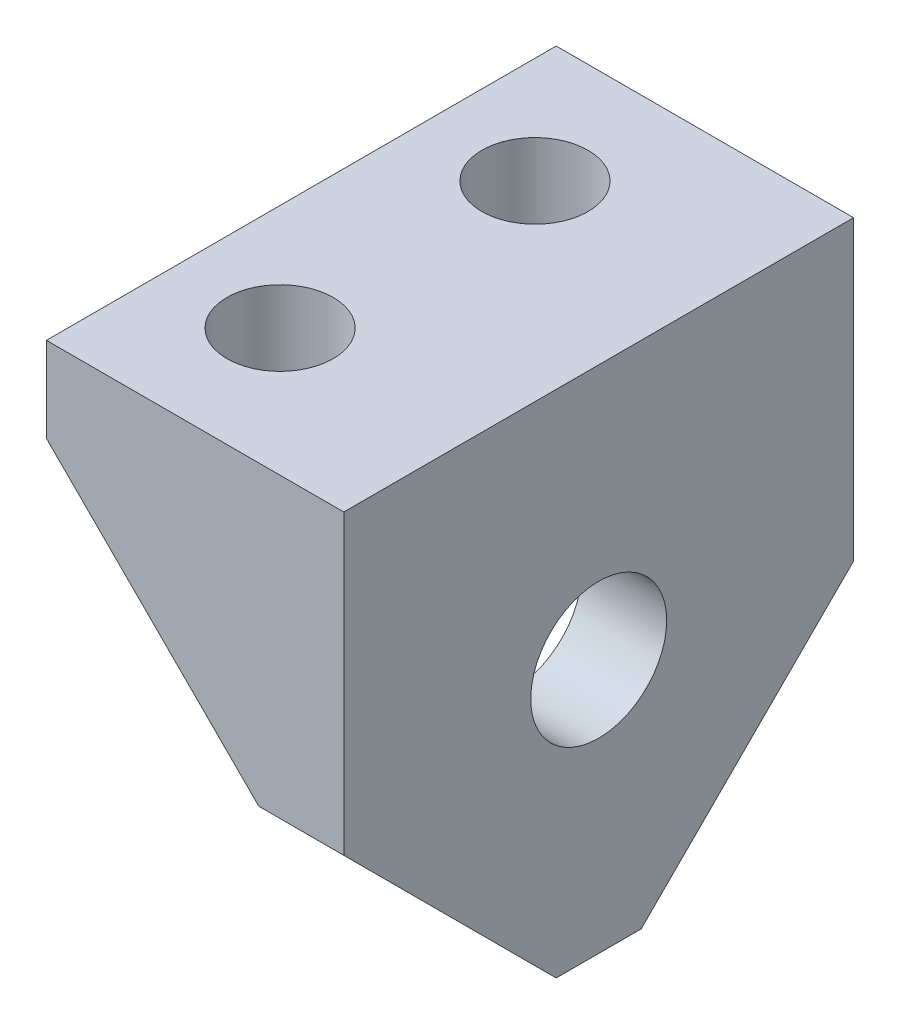
ISO-10303-21;
HEADER;
FILE_DESCRIPTION(('STEP AP214'),'2;1');
FILE_NAME('part.step','',(''),(''),'','','');
FILE_SCHEMA(('AUTOMOTIVE_DESIGN { 1 0 10303 214 1 1 1 1 }'));
ENDSEC;
DATA;
#1=APPLICATION_CONTEXT('core data for automotive mechanical design processes');
#2=APPLICATION_PROTOCOL_DEFINITION('international standard','automotive_design',2000,#1);
#3=PRODUCT_CONTEXT('',#1,'mechanical');
#4=PRODUCT('Part','Part','',(#3));
#5=PRODUCT_RELATED_PRODUCT_CATEGORY('part','',(#4));
#6=PRODUCT_DEFINITION_FORMATION('','',#4);
#7=PRODUCT_DEFINITION_CONTEXT('part definition',#1,'design');
#8=PRODUCT_DEFINITION('design','',#6,#7);
#9=PRODUCT_DEFINITION_SHAPE('','',#8);
#10=(LENGTH_UNIT() NAMED_UNIT(*) SI_UNIT(.MILLI.,.METRE.));
#11=(NAMED_UNIT(*) PLANE_ANGLE_UNIT() SI_UNIT($,.RADIAN.));
#12=(NAMED_UNIT(*) SI_UNIT($,.STERADIAN.) SOLID_ANGLE_UNIT());
#13=UNCERTAINTY_MEASURE_WITH_UNIT(LENGTH_MEASURE(1.E-05),#10,'distance_accuracy_value','');
#14=(GEOMETRIC_REPRESENTATION_CONTEXT(3) GLOBAL_UNCERTAINTY_ASSIGNED_CONTEXT((#13)) GLOBAL_UNIT_ASSIGNED_CONTEXT((#10,
#11,#12)) REPRESENTATION_CONTEXT('',''));
#15=CARTESIAN_POINT('',(0.,0.,0.));
#16=DIRECTION('',(0.,0.,1.));
#17=DIRECTION('',(1.,0.,0.));
#18=AXIS2_PLACEMENT_3D('',#15,#16,#17);
#19=CARTESIAN_POINT('',(0.,0.,0.));
#20=DIRECTION('',(1.,0.,0.));
#21=DIRECTION('',(0.,0.,-1.));
#22=AXIS2_PLACEMENT_3D('',#19,#20,#21);
#23=PLANE('',#22);
#24=CARTESIAN_POINT('',(0.,-1.51177041663371,0.));
#25=DIRECTION('',(1.,0.,0.));
#26=DIRECTION('',(0.,0.,-1.));
#27=AXIS2_PLACEMENT_3D('',#24,#25,#26);
#28=CIRCLE('',#27,1.6);
#29=CARTESIAN_POINT('',(0.,-1.51177041663371,-1.6));
#30=VERTEX_POINT('',#29);
#31=EDGE_CURVE('E195',#30,#30,#28,.T.);
#32=ORIENTED_EDGE('',*,*,#31,.T.);
#33=EDGE_LOOP('',(#32));
#34=FACE_BOUND('',#33,.T.);
#35=DIRECTION('',(0.,0.,-1.));
#36=VECTOR('',#35,1.);
#37=CARTESIAN_POINT('',(0.,-2.5,-4.5));
#38=LINE('',#37,#36);
#39=CARTESIAN_POINT('',(0.,-2.5,-4.5));
#40=VERTEX_POINT('',#39);
#41=CARTESIAN_POINT('',(0.,-2.5,-6.));
#42=VERTEX_POINT('',#41);
#43=EDGE_CURVE('E120',#40,#42,#38,.T.);
#44=ORIENTED_EDGE('',*,*,#43,.T.);
#45=DIRECTION('',(0.,-0.707106781186548,0.707106781186548));
#46=VECTOR('',#45,1.);
#47=CARTESIAN_POINT('',(0.,-4.25,-4.25));
#48=LINE('',#47,#46);
#49=CARTESIAN_POINT('',(0.,-7.5,-1.));
#50=VERTEX_POINT('',#49);
#51=EDGE_CURVE('E139',#42,#50,#48,.T.);
#52=ORIENTED_EDGE('',*,*,#51,.T.);
#53=DIRECTION('',(0.,0.,-1.));
#54=VECTOR('',#53,1.);
#55=CARTESIAN_POINT('',(0.,-7.5,6.));
#56=LINE('',#55,#54);
#57=CARTESIAN_POINT('',(0.,-7.5,0.999999999999998));
#58=VERTEX_POINT('',#57);
#59=EDGE_CURVE('E149',#58,#50,#56,.T.);
#60=ORIENTED_EDGE('',*,*,#59,.F.);
#61=DIRECTION('',(0.,0.707106781186547,0.707106781186548));
#62=VECTOR('',#61,1.);
#63=CARTESIAN_POINT('',(0.,-4.25,4.25));
#64=LINE('',#63,#62);
#65=CARTESIAN_POINT('',(0.,-2.5,6.));
#66=VERTEX_POINT('',#65);
#67=EDGE_CURVE('E134',#58,#66,#64,.T.);
#68=ORIENTED_EDGE('',*,*,#67,.T.);
#69=DIRECTION('',(0.,0.,1.));
#70=VECTOR('',#69,1.);
#71=CARTESIAN_POINT('',(0.,-2.5,4.5));
#72=LINE('',#71,#70);
#73=CARTESIAN_POINT('',(0.,-2.5,4.5));
#74=VERTEX_POINT('',#73);
#75=EDGE_CURVE('E217',#74,#66,#72,.T.);
#76=ORIENTED_EDGE('',*,*,#75,.F.);
#77=DIRECTION('',(0.,1.,0.));
#78=VECTOR('',#77,1.);
#79=CARTESIAN_POINT('',(0.,2.5,4.5));
#80=LINE('',#79,#78);
#81=CARTESIAN_POINT('',(0.,2.5,4.5));
#82=VERTEX_POINT('',#81);
#83=EDGE_CURVE('E132',#74,#82,#80,.T.);
#84=ORIENTED_EDGE('',*,*,#83,.T.);
#85=DIRECTION('',(0.,0.,1.));
#86=VECTOR('',#85,1.);
#87=CARTESIAN_POINT('',(0.,2.5,-6.));
#88=LINE('',#87,#86);
#89=CARTESIAN_POINT('',(0.,2.5,-4.5));
#90=VERTEX_POINT('',#89);
#91=EDGE_CURVE('E125',#90,#82,#88,.T.);
#92=ORIENTED_EDGE('',*,*,#91,.F.);
#93=DIRECTION('',(0.,1.,0.));
#94=VECTOR('',#93,1.);
#95=CARTESIAN_POINT('',(0.,2.5,-4.5));
#96=LINE('',#95,#94);
#97=EDGE_CURVE('E112',#40,#90,#96,.T.);
#98=ORIENTED_EDGE('',*,*,#97,.F.);
#99=EDGE_LOOP('',(#44,#52,#60,#68,#76,#84,#92,#98));
#100=FACE_BOUND('',#99,.T.);
#101=ADVANCED_FACE('F36',(#34,#100),#23,.F.);
#102=CARTESIAN_POINT('',(2.,4.5,6.));
#103=DIRECTION('',(0.,0.,-1.));
#104=DIRECTION('',(0.,1.,0.));
#105=AXIS2_PLACEMENT_3D('',#102,#103,#104);
#106=PLANE('',#105);
#107=DIRECTION('',(0.707106781186548,-0.707106781186548,0.));
#108=VECTOR('',#107,1.);
#109=CARTESIAN_POINT('',(-5.,2.5,6.));
#110=LINE('',#109,#108);
#111=CARTESIAN_POINT('',(-5.,2.5,6.));
#112=VERTEX_POINT('',#111);
#113=EDGE_CURVE('E221',#112,#66,#110,.T.);
#114=ORIENTED_EDGE('',*,*,#113,.T.);
#115=DIRECTION('',(1.,0.,0.));
#116=VECTOR('',#115,1.);
#117=CARTESIAN_POINT('',(-3.,-2.5,6.));
#118=LINE('',#117,#116);
#119=CARTESIAN_POINT('',(2.,-2.5,6.));
#120=VERTEX_POINT('',#119);
#121=EDGE_CURVE('E187',#66,#120,#118,.T.);
#122=ORIENTED_EDGE('',*,*,#121,.T.);
#123=DIRECTION('',(0.,-1.,0.));
#124=VECTOR('',#123,1.);
#125=CARTESIAN_POINT('',(2.,4.5,6.));
#126=LINE('',#125,#124);
#127=CARTESIAN_POINT('',(2.,4.5,6.));
#128=VERTEX_POINT('',#127);
#129=EDGE_CURVE('E145',#128,#120,#126,.T.);
#130=ORIENTED_EDGE('',*,*,#129,.F.);
#131=DIRECTION('',(-1.,0.,0.));
#132=VECTOR('',#131,1.);
#133=CARTESIAN_POINT('',(2.,4.5,6.));
#134=LINE('',#133,#132);
#135=CARTESIAN_POINT('',(-5.,4.5,6.));
#136=VERTEX_POINT('',#135);
#137=EDGE_CURVE('E44',#128,#136,#134,.T.);
#138=ORIENTED_EDGE('',*,*,#137,.T.);
#139=DIRECTION('',(0.,1.,0.));
#140=VECTOR('',#139,1.);
#141=CARTESIAN_POINT('',(-5.,4.5,6.));
#142=LINE('',#141,#140);
#143=EDGE_CURVE('E163',#112,#136,#142,.T.);
#144=ORIENTED_EDGE('',*,*,#143,.F.);
#145=EDGE_LOOP('',(#114,#122,#130,#138,#144));
#146=FACE_BOUND('',#145,.T.);
#147=ADVANCED_FACE('F38',(#146),#106,.F.);
#148=CARTESIAN_POINT('',(2.,-7.5,6.));
#149=DIRECTION('',(0.,1.,0.));
#150=DIRECTION('',(0.,0.,1.));
#151=AXIS2_PLACEMENT_3D('',#148,#149,#150);
#152=PLANE('',#151);
#153=DIRECTION('',(0.,0.,-1.));
#154=VECTOR('',#153,1.);
#155=CARTESIAN_POINT('',(2.,-7.5,6.));
#156=LINE('',#155,#154);
#157=CARTESIAN_POINT('',(2.,-7.5,0.999999999999998));
#158=VERTEX_POINT('',#157);
#159=CARTESIAN_POINT('',(2.,-7.5,-1.));
#160=VERTEX_POINT('',#159);
#161=EDGE_CURVE('E148',#158,#160,#156,.T.);
#162=ORIENTED_EDGE('',*,*,#161,.F.);
#163=DIRECTION('',(1.,0.,0.));
#164=VECTOR('',#163,1.);
#165=CARTESIAN_POINT('',(-3.,-7.5,0.999999999999998));
#166=LINE('',#165,#164);
#167=EDGE_CURVE('E196',#58,#158,#166,.T.);
#168=ORIENTED_EDGE('',*,*,#167,.F.);
#169=ORIENTED_EDGE('',*,*,#59,.T.);
#170=DIRECTION('',(1.,0.,0.));
#171=VECTOR('',#170,1.);
#172=CARTESIAN_POINT('',(-3.,-7.5,-1.));
#173=LINE('',#172,#171);
#174=EDGE_CURVE('E189',#50,#160,#173,.T.);
#175=ORIENTED_EDGE('',*,*,#174,.T.);
#176=EDGE_LOOP('',(#162,#168,#169,#175));
#177=FACE_BOUND('',#176,.T.);
#178=ADVANCED_FACE('F235',(#177),#152,.F.);
#179=CARTESIAN_POINT('',(2.,4.5,-6.));
#180=DIRECTION('',(0.,0.,1.));
#181=DIRECTION('',(0.,-1.,0.));
#182=AXIS2_PLACEMENT_3D('',#179,#180,#181);
#183=PLANE('',#182);
#184=DIRECTION('',(0.,1.,0.));
#185=VECTOR('',#184,1.);
#186=CARTESIAN_POINT('',(2.,4.5,-6.));
#187=LINE('',#186,#185);
#188=CARTESIAN_POINT('',(2.,-2.5,-6.));
#189=VERTEX_POINT('',#188);
#190=CARTESIAN_POINT('',(2.,4.5,-6.));
#191=VERTEX_POINT('',#190);
#192=EDGE_CURVE('E152',#189,#191,#187,.T.);
#193=ORIENTED_EDGE('',*,*,#192,.F.);
#194=DIRECTION('',(1.,0.,0.));
#195=VECTOR('',#194,1.);
#196=CARTESIAN_POINT('',(-3.,-2.5,-6.));
#197=LINE('',#196,#195);
#198=EDGE_CURVE('E59',#42,#189,#197,.T.);
#199=ORIENTED_EDGE('',*,*,#198,.F.);
#200=DIRECTION('',(0.707106781186548,-0.707106781186548,0.));
#201=VECTOR('',#200,1.);
#202=CARTESIAN_POINT('',(-5.,2.5,-6.));
#203=LINE('',#202,#201);
#204=CARTESIAN_POINT('',(-5.,2.5,-6.));
#205=VERTEX_POINT('',#204);
#206=EDGE_CURVE('E182',#205,#42,#203,.T.);
#207=ORIENTED_EDGE('',*,*,#206,.F.);
#208=DIRECTION('',(0.,-1.,0.));
#209=VECTOR('',#208,1.);
#210=CARTESIAN_POINT('',(-5.,4.5,-6.));
#211=LINE('',#210,#209);
#212=CARTESIAN_POINT('',(-5.,4.5,-6.));
#213=VERTEX_POINT('',#212);
#214=EDGE_CURVE('E133',#213,#205,#211,.T.);
#215=ORIENTED_EDGE('',*,*,#214,.F.);
#216=DIRECTION('',(-1.,0.,0.));
#217=VECTOR('',#216,1.);
#218=CARTESIAN_POINT('',(2.,4.5,-6.));
#219=LINE('',#218,#217);
#220=EDGE_CURVE('E11',#191,#213,#219,.T.);
#221=ORIENTED_EDGE('',*,*,#220,.F.);
#222=EDGE_LOOP('',(#193,#199,#207,#215,#221));
#223=FACE_BOUND('',#222,.T.);
#224=ADVANCED_FACE('F180',(#223),#183,.F.);
#225=CARTESIAN_POINT('',(2.,4.5,6.));
#226=DIRECTION('',(0.,-1.,0.));
#227=DIRECTION('',(0.,0.,-1.));
#228=AXIS2_PLACEMENT_3D('',#225,#226,#227);
#229=PLANE('',#228);
#230=CARTESIAN_POINT('',(-2.5,4.5,3.));
#231=DIRECTION('',(0.,-1.,0.));
#232=DIRECTION('',(0.,0.,-1.));
#233=AXIS2_PLACEMENT_3D('',#230,#231,#232);
#234=CIRCLE('',#233,1.25);
#235=CARTESIAN_POINT('',(-2.5,4.5,1.75));
#236=VERTEX_POINT('',#235);
#237=EDGE_CURVE('E205',#236,#236,#234,.T.);
#238=ORIENTED_EDGE('',*,*,#237,.T.);
#239=EDGE_LOOP('',(#238));
#240=FACE_BOUND('',#239,.T.);
#241=CARTESIAN_POINT('',(-2.5,4.5,-3.));
#242=DIRECTION('',(0.,-1.,0.));
#243=DIRECTION('',(0.,0.,-1.));
#244=AXIS2_PLACEMENT_3D('',#241,#242,#243);
#245=CIRCLE('',#244,1.25);
#246=CARTESIAN_POINT('',(-2.5,4.5,-4.25));
#247=VERTEX_POINT('',#246);
#248=EDGE_CURVE('E208',#247,#247,#245,.T.);
#249=ORIENTED_EDGE('',*,*,#248,.T.);
#250=EDGE_LOOP('',(#249));
#251=FACE_BOUND('',#250,.T.);
#252=ORIENTED_EDGE('',*,*,#220,.T.);
#253=DIRECTION('',(0.,0.,-1.));
#254=VECTOR('',#253,1.);
#255=CARTESIAN_POINT('',(-5.,4.5,-6.));
#256=LINE('',#255,#254);
#257=EDGE_CURVE('E143',#136,#213,#256,.T.);
#258=ORIENTED_EDGE('',*,*,#257,.F.);
#259=ORIENTED_EDGE('',*,*,#137,.F.);
#260=DIRECTION('',(0.,0.,1.));
#261=VECTOR('',#260,1.);
#262=CARTESIAN_POINT('',(2.,4.5,6.));
#263=LINE('',#262,#261);
#264=EDGE_CURVE('E154',#191,#128,#263,.T.);
#265=ORIENTED_EDGE('',*,*,#264,.F.);
#266=EDGE_LOOP('',(#252,#258,#259,#265));
#267=FACE_BOUND('',#266,.T.);
#268=ADVANCED_FACE('F176',(#240,#251,#267),#229,.F.);
#269=CARTESIAN_POINT('',(2.,0.,0.));
#270=DIRECTION('',(1.,0.,0.));
#271=DIRECTION('',(0.,0.,-1.));
#272=AXIS2_PLACEMENT_3D('',#269,#270,#271);
#273=PLANE('',#272);
#274=CARTESIAN_POINT('',(2.,-1.51177041663371,0.));
#275=DIRECTION('',(1.,0.,0.));
#276=DIRECTION('',(0.,0.,-1.));
#277=AXIS2_PLACEMENT_3D('',#274,#275,#276);
#278=CIRCLE('',#277,1.6);
#279=CARTESIAN_POINT('',(2.,-1.51177041663371,-1.6));
#280=VERTEX_POINT('',#279);
#281=EDGE_CURVE('E202',#280,#280,#278,.T.);
#282=ORIENTED_EDGE('',*,*,#281,.F.);
#283=EDGE_LOOP('',(#282));
#284=FACE_BOUND('',#283,.T.);
#285=DIRECTION('',(0.,0.707106781186547,0.707106781186548));
#286=VECTOR('',#285,1.);
#287=CARTESIAN_POINT('',(2.,-2.5,6.));
#288=LINE('',#287,#286);
#289=EDGE_CURVE('E193',#158,#120,#288,.T.);
#290=ORIENTED_EDGE('',*,*,#289,.F.);
#291=ORIENTED_EDGE('',*,*,#161,.T.);
#292=DIRECTION('',(0.,-0.707106781186548,0.707106781186548));
#293=VECTOR('',#292,1.);
#294=CARTESIAN_POINT('',(2.,-2.5,-6.));
#295=LINE('',#294,#293);
#296=EDGE_CURVE('E190',#189,#160,#295,.T.);
#297=ORIENTED_EDGE('',*,*,#296,.F.);
#298=ORIENTED_EDGE('',*,*,#192,.T.);
#299=ORIENTED_EDGE('',*,*,#264,.T.);
#300=ORIENTED_EDGE('',*,*,#129,.T.);
#301=EDGE_LOOP('',(#290,#291,#297,#298,#299,#300));
#302=FACE_BOUND('',#301,.T.);
#303=ADVANCED_FACE('F239',(#284,#302),#273,.T.);
#304=CARTESIAN_POINT('',(-5.,2.5,-6.));
#305=DIRECTION('',(0.,1.,0.));
#306=DIRECTION('',(0.,0.,1.));
#307=AXIS2_PLACEMENT_3D('',#304,#305,#306);
#308=PLANE('',#307);
#309=CARTESIAN_POINT('',(-2.5,2.5,3.));
#310=DIRECTION('',(0.,-1.,0.));
#311=DIRECTION('',(0.,0.,-1.));
#312=AXIS2_PLACEMENT_3D('',#309,#310,#311);
#313=CIRCLE('',#312,1.25);
#314=CARTESIAN_POINT('',(-2.5,2.5,1.75));
#315=VERTEX_POINT('',#314);
#316=EDGE_CURVE('E211',#315,#315,#313,.T.);
#317=ORIENTED_EDGE('',*,*,#316,.F.);
#318=EDGE_LOOP('',(#317));
#319=FACE_BOUND('',#318,.T.);
#320=CARTESIAN_POINT('',(-2.5,2.5,-3.));
#321=DIRECTION('',(0.,-1.,0.));
#322=DIRECTION('',(0.,0.,-1.));
#323=AXIS2_PLACEMENT_3D('',#320,#321,#322);
#324=CIRCLE('',#323,1.25);
#325=CARTESIAN_POINT('',(-2.5,2.5,-4.25));
#326=VERTEX_POINT('',#325);
#327=EDGE_CURVE('E212',#326,#326,#324,.T.);
#328=ORIENTED_EDGE('',*,*,#327,.F.);
#329=EDGE_LOOP('',(#328));
#330=FACE_BOUND('',#329,.T.);
#331=DIRECTION('',(0.,0.,1.));
#332=VECTOR('',#331,1.);
#333=CARTESIAN_POINT('',(-5.,2.5,-6.));
#334=LINE('',#333,#332);
#335=CARTESIAN_POINT('',(-5.,2.5,-4.5));
#336=VERTEX_POINT('',#335);
#337=CARTESIAN_POINT('',(-5.,2.5,4.5));
#338=VERTEX_POINT('',#337);
#339=EDGE_CURVE('E127',#336,#338,#334,.T.);
#340=ORIENTED_EDGE('',*,*,#339,.F.);
#341=DIRECTION('',(-1.,0.,0.));
#342=VECTOR('',#341,1.);
#343=CARTESIAN_POINT('',(-5.,2.5,-4.5));
#344=LINE('',#343,#342);
#345=EDGE_CURVE('E115',#90,#336,#344,.T.);
#346=ORIENTED_EDGE('',*,*,#345,.F.);
#347=ORIENTED_EDGE('',*,*,#91,.T.);
#348=DIRECTION('',(-1.,0.,0.));
#349=VECTOR('',#348,1.);
#350=CARTESIAN_POINT('',(-5.,2.5,4.5));
#351=LINE('',#350,#349);
#352=EDGE_CURVE('E219',#82,#338,#351,.T.);
#353=ORIENTED_EDGE('',*,*,#352,.T.);
#354=EDGE_LOOP('',(#340,#346,#347,#353));
#355=FACE_BOUND('',#354,.T.);
#356=ADVANCED_FACE('F123',(#319,#330,#355),#308,.F.);
#357=CARTESIAN_POINT('',(-5.,0.,0.));
#358=DIRECTION('',(-1.,0.,0.));
#359=DIRECTION('',(0.,0.,1.));
#360=AXIS2_PLACEMENT_3D('',#357,#358,#359);
#361=PLANE('',#360);
#362=ORIENTED_EDGE('',*,*,#214,.T.);
#363=EDGE_CURVE('E175',#205,#336,#334,.T.);
#364=ORIENTED_EDGE('',*,*,#363,.T.);
#365=ORIENTED_EDGE('',*,*,#339,.T.);
#366=DIRECTION('',(0.,0.,1.));
#367=VECTOR('',#366,1.);
#368=CARTESIAN_POINT('',(-5.,2.5,4.5));
#369=LINE('',#368,#367);
#370=EDGE_CURVE('E174',#338,#112,#369,.T.);
#371=ORIENTED_EDGE('',*,*,#370,.T.);
#372=ORIENTED_EDGE('',*,*,#143,.T.);
#373=ORIENTED_EDGE('',*,*,#257,.T.);
#374=EDGE_LOOP('',(#362,#364,#365,#371,#372,#373));
#375=FACE_BOUND('',#374,.T.);
#376=ADVANCED_FACE('F171',(#375),#361,.T.);
#377=CARTESIAN_POINT('',(-3.,-2.5,-6.));
#378=DIRECTION('',(0.,0.707106781186548,0.707106781186548));
#379=DIRECTION('',(0.,-0.707106781186548,0.707106781186548));
#380=AXIS2_PLACEMENT_3D('',#377,#378,#379);
#381=PLANE('',#380);
#382=ORIENTED_EDGE('',*,*,#198,.T.);
#383=ORIENTED_EDGE('',*,*,#296,.T.);
#384=ORIENTED_EDGE('',*,*,#174,.F.);
#385=ORIENTED_EDGE('',*,*,#51,.F.);
#386=EDGE_LOOP('',(#382,#383,#384,#385));
#387=FACE_BOUND('',#386,.T.);
#388=ADVANCED_FACE('F232',(#387),#381,.F.);
#389=CARTESIAN_POINT('',(-3.,-2.5,6.));
#390=DIRECTION('',(0.,0.707106781186548,-0.707106781186547));
#391=DIRECTION('',(0.,0.707106781186547,0.707106781186548));
#392=AXIS2_PLACEMENT_3D('',#389,#390,#391);
#393=PLANE('',#392);
#394=ORIENTED_EDGE('',*,*,#167,.T.);
#395=ORIENTED_EDGE('',*,*,#289,.T.);
#396=ORIENTED_EDGE('',*,*,#121,.F.);
#397=ORIENTED_EDGE('',*,*,#67,.F.);
#398=EDGE_LOOP('',(#394,#395,#396,#397));
#399=FACE_BOUND('',#398,.T.);
#400=ADVANCED_FACE('F242',(#399),#393,.F.);
#401=CARTESIAN_POINT('',(-3.,-1.51177041663371,0.));
#402=DIRECTION('',(1.,0.,0.));
#403=DIRECTION('',(0.,0.,-1.));
#404=AXIS2_PLACEMENT_3D('',#401,#402,#403);
#405=CYLINDRICAL_SURFACE('',#404,1.6);
#406=ORIENTED_EDGE('',*,*,#281,.T.);
#407=EDGE_LOOP('',(#406));
#408=FACE_BOUND('',#407,.T.);
#409=ORIENTED_EDGE('',*,*,#31,.F.);
#410=EDGE_LOOP('',(#409));
#411=FACE_BOUND('',#410,.T.);
#412=ADVANCED_FACE('F316',(#408,#411),#405,.F.);
#413=CARTESIAN_POINT('',(-2.5,7.5,-3.));
#414=DIRECTION('',(0.,-1.,0.));
#415=DIRECTION('',(0.,0.,-1.));
#416=AXIS2_PLACEMENT_3D('',#413,#414,#415);
#417=CYLINDRICAL_SURFACE('',#416,1.25);
#418=ORIENTED_EDGE('',*,*,#327,.T.);
#419=EDGE_LOOP('',(#418));
#420=FACE_BOUND('',#419,.T.);
#421=ORIENTED_EDGE('',*,*,#248,.F.);
#422=EDGE_LOOP('',(#421));
#423=FACE_BOUND('',#422,.T.);
#424=ADVANCED_FACE('F323',(#420,#423),#417,.F.);
#425=CARTESIAN_POINT('',(-2.5,7.5,3.));
#426=DIRECTION('',(0.,-1.,0.));
#427=DIRECTION('',(0.,0.,-1.));
#428=AXIS2_PLACEMENT_3D('',#425,#426,#427);
#429=CYLINDRICAL_SURFACE('',#428,1.25);
#430=ORIENTED_EDGE('',*,*,#316,.T.);
#431=EDGE_LOOP('',(#430));
#432=FACE_BOUND('',#431,.T.);
#433=ORIENTED_EDGE('',*,*,#237,.F.);
#434=EDGE_LOOP('',(#433));
#435=FACE_BOUND('',#434,.T.);
#436=ADVANCED_FACE('F255',(#432,#435),#429,.F.);
#437=CARTESIAN_POINT('',(-5.,2.5,4.5));
#438=DIRECTION('',(-0.707106781186547,-0.707106781186547,0.));
#439=DIRECTION('',(0.707106781186548,-0.707106781186548,0.));
#440=AXIS2_PLACEMENT_3D('',#437,#438,#439);
#441=PLANE('',#440);
#442=ORIENTED_EDGE('',*,*,#113,.F.);
#443=ORIENTED_EDGE('',*,*,#370,.F.);
#444=DIRECTION('',(0.707106781186548,-0.707106781186548,0.));
#445=VECTOR('',#444,1.);
#446=CARTESIAN_POINT('',(-5.,2.5,4.5));
#447=LINE('',#446,#445);
#448=EDGE_CURVE('E223',#338,#74,#447,.T.);
#449=ORIENTED_EDGE('',*,*,#448,.T.);
#450=ORIENTED_EDGE('',*,*,#75,.T.);
#451=EDGE_LOOP('',(#442,#443,#449,#450));
#452=FACE_BOUND('',#451,.T.);
#453=ADVANCED_FACE('F244',(#452),#441,.T.);
#454=CARTESIAN_POINT('',(0.,0.,4.5));
#455=DIRECTION('',(0.,0.,-1.));
#456=DIRECTION('',(-1.,0.,0.));
#457=AXIS2_PLACEMENT_3D('',#454,#455,#456);
#458=PLANE('',#457);
#459=ORIENTED_EDGE('',*,*,#448,.F.);
#460=ORIENTED_EDGE('',*,*,#352,.F.);
#461=ORIENTED_EDGE('',*,*,#83,.F.);
#462=EDGE_LOOP('',(#459,#460,#461));
#463=FACE_BOUND('',#462,.T.);
#464=ADVANCED_FACE('F247',(#463),#458,.T.);
#465=CARTESIAN_POINT('',(-5.,2.5,-4.5));
#466=DIRECTION('',(0.707106781186547,0.707106781186547,0.));
#467=DIRECTION('',(-0.707106781186548,0.707106781186548,0.));
#468=AXIS2_PLACEMENT_3D('',#465,#466,#467);
#469=PLANE('',#468);
#470=ORIENTED_EDGE('',*,*,#206,.T.);
#471=ORIENTED_EDGE('',*,*,#43,.F.);
#472=DIRECTION('',(0.707106781186548,-0.707106781186548,0.));
#473=VECTOR('',#472,1.);
#474=CARTESIAN_POINT('',(-5.,2.5,-4.5));
#475=LINE('',#474,#473);
#476=EDGE_CURVE('E51',#336,#40,#475,.T.);
#477=ORIENTED_EDGE('',*,*,#476,.F.);
#478=ORIENTED_EDGE('',*,*,#363,.F.);
#479=EDGE_LOOP('',(#470,#471,#477,#478));
#480=FACE_BOUND('',#479,.T.);
#481=ADVANCED_FACE('F230',(#480),#469,.F.);
#482=CARTESIAN_POINT('',(0.,0.,-4.5));
#483=DIRECTION('',(0.,0.,1.));
#484=DIRECTION('',(-1.,0.,0.));
#485=AXIS2_PLACEMENT_3D('',#482,#483,#484);
#486=PLANE('',#485);
#487=ORIENTED_EDGE('',*,*,#476,.T.);
#488=ORIENTED_EDGE('',*,*,#97,.T.);
#489=ORIENTED_EDGE('',*,*,#345,.T.);
#490=EDGE_LOOP('',(#487,#488,#489));
#491=FACE_BOUND('',#490,.T.);
#492=ADVANCED_FACE('F114',(#491),#486,.T.);
#493=CLOSED_SHELL('',(#101,#147,#178,#224,#268,#303,#356,#376,#388,#400,#412,#424,#436,#453,
#464,#481,#492));
#494=MANIFOLD_SOLID_BREP('B2',#493);
#495=ADVANCED_BREP_SHAPE_REPRESENTATION('',(#18,#494),#14);
#496=SHAPE_DEFINITION_REPRESENTATION(#9,#495);
ENDSEC;
END-ISO-10303-21;
